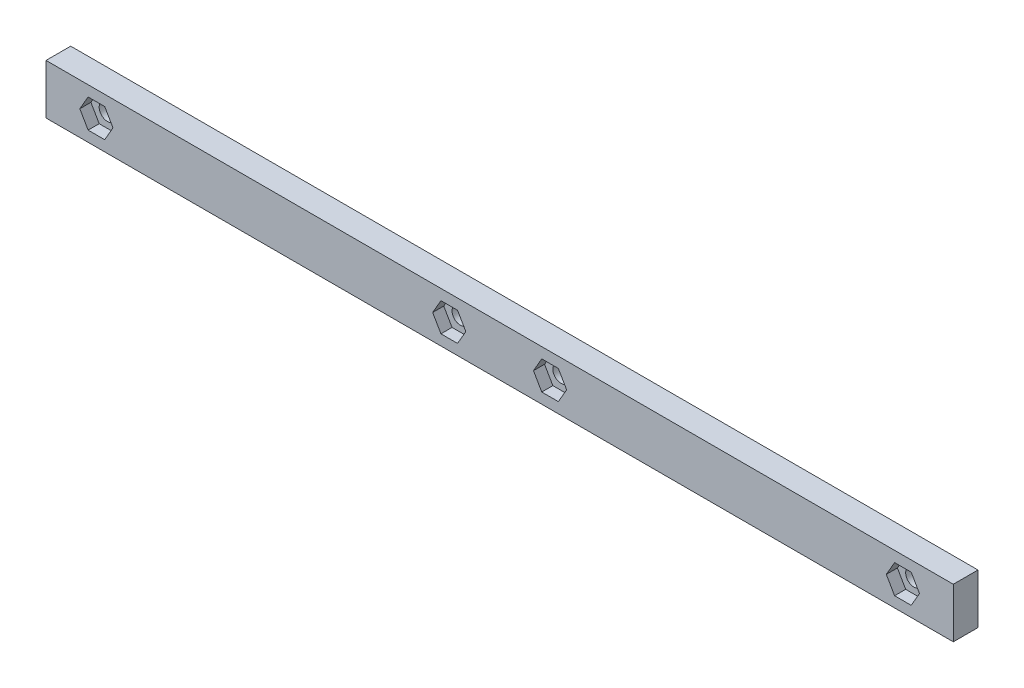
ISO-10303-21;
HEADER;
FILE_DESCRIPTION(('STEP AP214'),'2;1');
FILE_NAME('part.step','',(''),(''),'','','');
FILE_SCHEMA(('AUTOMOTIVE_DESIGN { 1 0 10303 214 1 1 1 1 }'));
ENDSEC;
DATA;
#1=APPLICATION_CONTEXT('core data for automotive mechanical design processes');
#2=APPLICATION_PROTOCOL_DEFINITION('international standard','automotive_design',2000,#1);
#3=PRODUCT_CONTEXT('',#1,'mechanical');
#4=PRODUCT('Part','Part','',(#3));
#5=PRODUCT_RELATED_PRODUCT_CATEGORY('part','',(#4));
#6=PRODUCT_DEFINITION_FORMATION('','',#4);
#7=PRODUCT_DEFINITION_CONTEXT('part definition',#1,'design');
#8=PRODUCT_DEFINITION('design','',#6,#7);
#9=PRODUCT_DEFINITION_SHAPE('','',#8);
#10=(LENGTH_UNIT() NAMED_UNIT(*) SI_UNIT(.MILLI.,.METRE.));
#11=(NAMED_UNIT(*) PLANE_ANGLE_UNIT() SI_UNIT($,.RADIAN.));
#12=(NAMED_UNIT(*) SI_UNIT($,.STERADIAN.) SOLID_ANGLE_UNIT());
#13=UNCERTAINTY_MEASURE_WITH_UNIT(LENGTH_MEASURE(1.E-05),#10,'distance_accuracy_value','');
#14=(GEOMETRIC_REPRESENTATION_CONTEXT(3) GLOBAL_UNCERTAINTY_ASSIGNED_CONTEXT((#13)) GLOBAL_UNIT_ASSIGNED_CONTEXT((#10,
#11,#12)) REPRESENTATION_CONTEXT('',''));
#15=CARTESIAN_POINT('',(0.,0.,0.));
#16=DIRECTION('',(0.,0.,1.));
#17=DIRECTION('',(1.,0.,0.));
#18=AXIS2_PLACEMENT_3D('',#15,#16,#17);
#19=CARTESIAN_POINT('',(23.6426528209278,33.440788784535,-4.9));
#20=DIRECTION('',(0.,0.,1.));
#21=DIRECTION('',(1.,0.,0.));
#22=AXIS2_PLACEMENT_3D('',#19,#20,#21);
#23=CYLINDRICAL_SURFACE('',#22,1.64999999999999);
#24=CARTESIAN_POINT('',(23.6426528209278,33.440788784535,-4.9));
#25=DIRECTION('',(0.,0.,1.));
#26=DIRECTION('',(1.,0.,0.));
#27=AXIS2_PLACEMENT_3D('',#24,#25,#26);
#28=CIRCLE('',#27,1.64999999999999);
#29=CARTESIAN_POINT('',(25.2926528209278,33.440788784535,-4.9));
#30=VERTEX_POINT('',#29);
#31=EDGE_CURVE('E425',#30,#30,#28,.T.);
#32=ORIENTED_EDGE('',*,*,#31,.F.);
#33=EDGE_LOOP('',(#32));
#34=FACE_BOUND('',#33,.T.);
#35=CARTESIAN_POINT('',(23.6426528209278,33.440788784535,-2.2));
#36=DIRECTION('',(0.,0.,1.));
#37=DIRECTION('',(1.,0.,0.));
#38=AXIS2_PLACEMENT_3D('',#35,#36,#37);
#39=CIRCLE('',#38,1.64999999999999);
#40=CARTESIAN_POINT('',(25.2926528209278,33.440788784535,-2.2));
#41=VERTEX_POINT('',#40);
#42=EDGE_CURVE('E43',#41,#41,#39,.F.);
#43=ORIENTED_EDGE('',*,*,#42,.F.);
#44=EDGE_LOOP('',(#43));
#45=FACE_BOUND('',#44,.T.);
#46=ADVANCED_FACE('F39',(#34,#45),#23,.F.);
#47=CARTESIAN_POINT('',(-46.3573471790721,33.440788784535,-4.9));
#48=DIRECTION('',(0.,0.,1.));
#49=DIRECTION('',(1.,0.,0.));
#50=AXIS2_PLACEMENT_3D('',#47,#48,#49);
#51=CYLINDRICAL_SURFACE('',#50,1.65);
#52=CARTESIAN_POINT('',(-46.3573471790721,33.440788784535,-4.9));
#53=DIRECTION('',(0.,0.,1.));
#54=DIRECTION('',(1.,0.,0.));
#55=AXIS2_PLACEMENT_3D('',#52,#53,#54);
#56=CIRCLE('',#55,1.65);
#57=CARTESIAN_POINT('',(-44.7073471790722,33.440788784535,-4.9));
#58=VERTEX_POINT('',#57);
#59=EDGE_CURVE('E428',#58,#58,#56,.T.);
#60=ORIENTED_EDGE('',*,*,#59,.F.);
#61=EDGE_LOOP('',(#60));
#62=FACE_BOUND('',#61,.T.);
#63=CARTESIAN_POINT('',(-46.3573471790721,33.440788784535,-2.2));
#64=DIRECTION('',(0.,0.,1.));
#65=DIRECTION('',(1.,0.,0.));
#66=AXIS2_PLACEMENT_3D('',#63,#64,#65);
#67=CIRCLE('',#66,1.65);
#68=CARTESIAN_POINT('',(-44.7073471790722,33.440788784535,-2.2));
#69=VERTEX_POINT('',#68);
#70=EDGE_CURVE('E317',#69,#69,#67,.F.);
#71=ORIENTED_EDGE('',*,*,#70,.F.);
#72=EDGE_LOOP('',(#71));
#73=FACE_BOUND('',#72,.T.);
#74=ADVANCED_FACE('F477',(#62,#73),#51,.F.);
#75=CARTESIAN_POINT('',(-66.357347179072,33.440788784535,-4.9));
#76=DIRECTION('',(0.,0.,1.));
#77=DIRECTION('',(1.,0.,0.));
#78=AXIS2_PLACEMENT_3D('',#75,#76,#77);
#79=CYLINDRICAL_SURFACE('',#78,1.64999999999999);
#80=CARTESIAN_POINT('',(-66.357347179072,33.440788784535,-4.9));
#81=DIRECTION('',(0.,0.,1.));
#82=DIRECTION('',(1.,0.,0.));
#83=AXIS2_PLACEMENT_3D('',#80,#81,#82);
#84=CIRCLE('',#83,1.64999999999999);
#85=CARTESIAN_POINT('',(-64.707347179072,33.440788784535,-4.9));
#86=VERTEX_POINT('',#85);
#87=EDGE_CURVE('E431',#86,#86,#84,.T.);
#88=ORIENTED_EDGE('',*,*,#87,.F.);
#89=EDGE_LOOP('',(#88));
#90=FACE_BOUND('',#89,.T.);
#91=CARTESIAN_POINT('',(-66.357347179072,33.440788784535,-2.2));
#92=DIRECTION('',(0.,0.,1.));
#93=DIRECTION('',(1.,0.,0.));
#94=AXIS2_PLACEMENT_3D('',#91,#92,#93);
#95=CIRCLE('',#94,1.64999999999999);
#96=CARTESIAN_POINT('',(-64.707347179072,33.440788784535,-2.2));
#97=VERTEX_POINT('',#96);
#98=EDGE_CURVE('E365',#97,#97,#95,.F.);
#99=ORIENTED_EDGE('',*,*,#98,.F.);
#100=EDGE_LOOP('',(#99));
#101=FACE_BOUND('',#100,.T.);
#102=ADVANCED_FACE('F479',(#90,#101),#79,.F.);
#103=CARTESIAN_POINT('',(-136.357347179072,33.4407887845351,-4.9));
#104=DIRECTION('',(0.,0.,1.));
#105=DIRECTION('',(1.,0.,0.));
#106=AXIS2_PLACEMENT_3D('',#103,#104,#105);
#107=CYLINDRICAL_SURFACE('',#106,1.64999999999999);
#108=CARTESIAN_POINT('',(-136.357347179072,33.4407887845351,-4.9));
#109=DIRECTION('',(0.,0.,1.));
#110=DIRECTION('',(1.,0.,0.));
#111=AXIS2_PLACEMENT_3D('',#108,#109,#110);
#112=CIRCLE('',#111,1.64999999999999);
#113=CARTESIAN_POINT('',(-134.707347179072,33.4407887845351,-4.9));
#114=VERTEX_POINT('',#113);
#115=EDGE_CURVE('E434',#114,#114,#112,.T.);
#116=ORIENTED_EDGE('',*,*,#115,.F.);
#117=EDGE_LOOP('',(#116));
#118=FACE_BOUND('',#117,.T.);
#119=CARTESIAN_POINT('',(-136.357347179072,33.4407887845351,-2.2));
#120=DIRECTION('',(0.,0.,1.));
#121=DIRECTION('',(1.,0.,0.));
#122=AXIS2_PLACEMENT_3D('',#119,#120,#121);
#123=CIRCLE('',#122,1.64999999999999);
#124=CARTESIAN_POINT('',(-134.707347179072,33.4407887845351,-2.2));
#125=VERTEX_POINT('',#124);
#126=EDGE_CURVE('E414',#125,#125,#123,.F.);
#127=ORIENTED_EDGE('',*,*,#126,.F.);
#128=EDGE_LOOP('',(#127));
#129=FACE_BOUND('',#128,.T.);
#130=ADVANCED_FACE('F486',(#118,#129),#107,.F.);
#131=CARTESIAN_POINT('',(-146.357347179072,38.3907887845349,-4.9));
#132=DIRECTION('',(-1.,0.,0.));
#133=DIRECTION('',(0.,0.,1.));
#134=AXIS2_PLACEMENT_3D('',#131,#132,#133);
#135=PLANE('',#134);
#136=DIRECTION('',(0.,-1.,0.));
#137=VECTOR('',#136,1.);
#138=CARTESIAN_POINT('',(-146.357347179072,38.3907887845349,0.));
#139=LINE('',#138,#137);
#140=CARTESIAN_POINT('',(-146.357347179072,38.3907887845349,0.));
#141=VERTEX_POINT('',#140);
#142=CARTESIAN_POINT('',(-146.357347179072,28.4907887845349,0.));
#143=VERTEX_POINT('',#142);
#144=EDGE_CURVE('E437',#141,#143,#139,.T.);
#145=ORIENTED_EDGE('',*,*,#144,.F.);
#146=DIRECTION('',(0.,0.,1.));
#147=VECTOR('',#146,1.);
#148=CARTESIAN_POINT('',(-146.357347179072,38.3907887845349,-4.9));
#149=LINE('',#148,#147);
#150=CARTESIAN_POINT('',(-146.357347179072,38.3907887845349,-4.9));
#151=VERTEX_POINT('',#150);
#152=EDGE_CURVE('E11',#151,#141,#149,.T.);
#153=ORIENTED_EDGE('',*,*,#152,.F.);
#154=DIRECTION('',(0.,-1.,0.));
#155=VECTOR('',#154,1.);
#156=CARTESIAN_POINT('',(-146.357347179072,38.3907887845349,-4.9));
#157=LINE('',#156,#155);
#158=CARTESIAN_POINT('',(-146.357347179072,28.4907887845349,-4.9));
#159=VERTEX_POINT('',#158);
#160=EDGE_CURVE('E438',#151,#159,#157,.T.);
#161=ORIENTED_EDGE('',*,*,#160,.T.);
#162=DIRECTION('',(0.,0.,1.));
#163=VECTOR('',#162,1.);
#164=CARTESIAN_POINT('',(-146.357347179072,28.4907887845349,-4.9));
#165=LINE('',#164,#163);
#166=EDGE_CURVE('E453',#159,#143,#165,.T.);
#167=ORIENTED_EDGE('',*,*,#166,.T.);
#168=EDGE_LOOP('',(#145,#153,#161,#167));
#169=FACE_BOUND('',#168,.T.);
#170=ADVANCED_FACE('F41',(#169),#135,.T.);
#171=CARTESIAN_POINT('',(-146.357347179072,38.3907887845349,-4.9));
#172=DIRECTION('',(0.,1.,0.));
#173=DIRECTION('',(0.,0.,1.));
#174=AXIS2_PLACEMENT_3D('',#171,#172,#173);
#175=PLANE('',#174);
#176=DIRECTION('',(-1.,0.,0.));
#177=VECTOR('',#176,1.);
#178=CARTESIAN_POINT('',(-146.357347179072,38.3907887845349,0.));
#179=LINE('',#178,#177);
#180=CARTESIAN_POINT('',(33.6426528209279,38.3907887845349,0.));
#181=VERTEX_POINT('',#180);
#182=EDGE_CURVE('E442',#181,#141,#179,.T.);
#183=ORIENTED_EDGE('',*,*,#182,.F.);
#184=DIRECTION('',(0.,0.,1.));
#185=VECTOR('',#184,1.);
#186=CARTESIAN_POINT('',(33.6426528209279,38.3907887845349,-4.9));
#187=LINE('',#186,#185);
#188=CARTESIAN_POINT('',(33.6426528209279,38.3907887845349,-4.9));
#189=VERTEX_POINT('',#188);
#190=EDGE_CURVE('E48',#189,#181,#187,.T.);
#191=ORIENTED_EDGE('',*,*,#190,.F.);
#192=DIRECTION('',(-1.,0.,0.));
#193=VECTOR('',#192,1.);
#194=CARTESIAN_POINT('',(-146.357347179072,38.3907887845349,-4.9));
#195=LINE('',#194,#193);
#196=EDGE_CURVE('E449',#189,#151,#195,.T.);
#197=ORIENTED_EDGE('',*,*,#196,.T.);
#198=ORIENTED_EDGE('',*,*,#152,.T.);
#199=EDGE_LOOP('',(#183,#191,#197,#198));
#200=FACE_BOUND('',#199,.T.);
#201=ADVANCED_FACE('F507',(#200),#175,.T.);
#202=CARTESIAN_POINT('',(33.6426528209279,38.3907887845349,-4.9));
#203=DIRECTION('',(1.,0.,0.));
#204=DIRECTION('',(0.,0.,-1.));
#205=AXIS2_PLACEMENT_3D('',#202,#203,#204);
#206=PLANE('',#205);
#207=DIRECTION('',(0.,1.,0.));
#208=VECTOR('',#207,1.);
#209=CARTESIAN_POINT('',(33.6426528209279,38.3907887845349,0.));
#210=LINE('',#209,#208);
#211=CARTESIAN_POINT('',(33.6426528209279,28.4907887845349,0.));
#212=VERTEX_POINT('',#211);
#213=EDGE_CURVE('E459',#212,#181,#210,.T.);
#214=ORIENTED_EDGE('',*,*,#213,.F.);
#215=DIRECTION('',(0.,0.,1.));
#216=VECTOR('',#215,1.);
#217=CARTESIAN_POINT('',(33.6426528209279,28.4907887845349,-4.9));
#218=LINE('',#217,#216);
#219=CARTESIAN_POINT('',(33.6426528209279,28.4907887845349,-4.9));
#220=VERTEX_POINT('',#219);
#221=EDGE_CURVE('E466',#220,#212,#218,.T.);
#222=ORIENTED_EDGE('',*,*,#221,.F.);
#223=DIRECTION('',(0.,1.,0.));
#224=VECTOR('',#223,1.);
#225=CARTESIAN_POINT('',(33.6426528209279,38.3907887845349,-4.9));
#226=LINE('',#225,#224);
#227=EDGE_CURVE('E446',#220,#189,#226,.T.);
#228=ORIENTED_EDGE('',*,*,#227,.T.);
#229=ORIENTED_EDGE('',*,*,#190,.T.);
#230=EDGE_LOOP('',(#214,#222,#228,#229));
#231=FACE_BOUND('',#230,.T.);
#232=ADVANCED_FACE('F510',(#231),#206,.T.);
#233=CARTESIAN_POINT('',(-146.357347179072,28.4907887845349,-4.9));
#234=DIRECTION('',(0.,-1.,0.));
#235=DIRECTION('',(0.,0.,-1.));
#236=AXIS2_PLACEMENT_3D('',#233,#234,#235);
#237=PLANE('',#236);
#238=DIRECTION('',(1.,0.,0.));
#239=VECTOR('',#238,1.);
#240=CARTESIAN_POINT('',(-146.357347179072,28.4907887845349,0.));
#241=LINE('',#240,#239);
#242=EDGE_CURVE('E456',#143,#212,#241,.T.);
#243=ORIENTED_EDGE('',*,*,#242,.F.);
#244=ORIENTED_EDGE('',*,*,#166,.F.);
#245=DIRECTION('',(1.,0.,0.));
#246=VECTOR('',#245,1.);
#247=CARTESIAN_POINT('',(-146.357347179072,28.4907887845349,-4.9));
#248=LINE('',#247,#246);
#249=EDGE_CURVE('E441',#159,#220,#248,.T.);
#250=ORIENTED_EDGE('',*,*,#249,.T.);
#251=ORIENTED_EDGE('',*,*,#221,.T.);
#252=EDGE_LOOP('',(#243,#244,#250,#251));
#253=FACE_BOUND('',#252,.T.);
#254=ADVANCED_FACE('F501',(#253),#237,.T.);
#255=CARTESIAN_POINT('',(0.,0.,-4.9));
#256=DIRECTION('',(0.,0.,1.));
#257=DIRECTION('',(1.,0.,0.));
#258=AXIS2_PLACEMENT_3D('',#255,#256,#257);
#259=PLANE('',#258);
#260=ORIENTED_EDGE('',*,*,#31,.T.);
#261=EDGE_LOOP('',(#260));
#262=FACE_BOUND('',#261,.T.);
#263=ORIENTED_EDGE('',*,*,#59,.T.);
#264=EDGE_LOOP('',(#263));
#265=FACE_BOUND('',#264,.T.);
#266=ORIENTED_EDGE('',*,*,#87,.T.);
#267=EDGE_LOOP('',(#266));
#268=FACE_BOUND('',#267,.T.);
#269=ORIENTED_EDGE('',*,*,#115,.T.);
#270=EDGE_LOOP('',(#269));
#271=FACE_BOUND('',#270,.T.);
#272=ORIENTED_EDGE('',*,*,#160,.F.);
#273=ORIENTED_EDGE('',*,*,#196,.F.);
#274=ORIENTED_EDGE('',*,*,#227,.F.);
#275=ORIENTED_EDGE('',*,*,#249,.F.);
#276=EDGE_LOOP('',(#272,#273,#274,#275));
#277=FACE_BOUND('',#276,.T.);
#278=ADVANCED_FACE('F497',(#262,#265,#268,#271,#277),#259,.F.);
#279=CARTESIAN_POINT('',(0.,0.,0.));
#280=DIRECTION('',(0.,0.,1.));
#281=DIRECTION('',(1.,0.,0.));
#282=AXIS2_PLACEMENT_3D('',#279,#280,#281);
#283=PLANE('',#282);
#284=DIRECTION('',(1.,0.,0.));
#285=VECTOR('',#284,1.);
#286=CARTESIAN_POINT('',(21.9972045537373,30.590788784535,0.));
#287=LINE('',#286,#285);
#288=CARTESIAN_POINT('',(21.9972045537373,30.590788784535,0.));
#289=VERTEX_POINT('',#288);
#290=CARTESIAN_POINT('',(25.2881010881182,30.590788784535,0.));
#291=VERTEX_POINT('',#290);
#292=EDGE_CURVE('E56',#289,#291,#287,.T.);
#293=ORIENTED_EDGE('',*,*,#292,.F.);
#294=DIRECTION('',(0.499999999999999,-0.866025403784439,0.));
#295=VECTOR('',#294,1.);
#296=CARTESIAN_POINT('',(20.3517562865469,33.440788784535,0.));
#297=LINE('',#296,#295);
#298=CARTESIAN_POINT('',(20.3517562865469,33.440788784535,0.));
#299=VERTEX_POINT('',#298);
#300=EDGE_CURVE('E247',#299,#289,#297,.T.);
#301=ORIENTED_EDGE('',*,*,#300,.F.);
#302=DIRECTION('',(-0.5,-0.866025403784439,0.));
#303=VECTOR('',#302,1.);
#304=CARTESIAN_POINT('',(21.9972045537373,36.290788784535,0.));
#305=LINE('',#304,#303);
#306=CARTESIAN_POINT('',(21.9972045537373,36.290788784535,0.));
#307=VERTEX_POINT('',#306);
#308=EDGE_CURVE('E250',#307,#299,#305,.T.);
#309=ORIENTED_EDGE('',*,*,#308,.F.);
#310=DIRECTION('',(-1.,0.,0.));
#311=VECTOR('',#310,1.);
#312=CARTESIAN_POINT('',(25.2881010881182,36.290788784535,0.));
#313=LINE('',#312,#311);
#314=CARTESIAN_POINT('',(25.2881010881182,36.290788784535,0.));
#315=VERTEX_POINT('',#314);
#316=EDGE_CURVE('E266',#315,#307,#313,.T.);
#317=ORIENTED_EDGE('',*,*,#316,.F.);
#318=DIRECTION('',(-0.5,0.866025403784439,0.));
#319=VECTOR('',#318,1.);
#320=CARTESIAN_POINT('',(26.9335493553086,33.440788784535,0.));
#321=LINE('',#320,#319);
#322=CARTESIAN_POINT('',(26.9335493553086,33.440788784535,0.));
#323=VERTEX_POINT('',#322);
#324=EDGE_CURVE('E263',#323,#315,#321,.T.);
#325=ORIENTED_EDGE('',*,*,#324,.F.);
#326=DIRECTION('',(0.499999999999999,0.866025403784439,0.));
#327=VECTOR('',#326,1.);
#328=CARTESIAN_POINT('',(25.2881010881182,30.590788784535,0.));
#329=LINE('',#328,#327);
#330=EDGE_CURVE('E261',#291,#323,#329,.T.);
#331=ORIENTED_EDGE('',*,*,#330,.F.);
#332=EDGE_LOOP('',(#293,#301,#309,#317,#325,#331));
#333=FACE_BOUND('',#332,.T.);
#334=DIRECTION('',(1.,0.,0.));
#335=VECTOR('',#334,1.);
#336=CARTESIAN_POINT('',(-48.0027954462626,30.590788784535,0.));
#337=LINE('',#336,#335);
#338=CARTESIAN_POINT('',(-48.0027954462626,30.590788784535,0.));
#339=VERTEX_POINT('',#338);
#340=CARTESIAN_POINT('',(-44.7118989118817,30.590788784535,0.));
#341=VERTEX_POINT('',#340);
#342=EDGE_CURVE('E64',#339,#341,#337,.T.);
#343=ORIENTED_EDGE('',*,*,#342,.F.);
#344=DIRECTION('',(0.5,-0.866025403784439,0.));
#345=VECTOR('',#344,1.);
#346=CARTESIAN_POINT('',(-49.648243713453,33.440788784535,0.));
#347=LINE('',#346,#345);
#348=CARTESIAN_POINT('',(-49.648243713453,33.440788784535,0.));
#349=VERTEX_POINT('',#348);
#350=EDGE_CURVE('E284',#349,#339,#347,.T.);
#351=ORIENTED_EDGE('',*,*,#350,.F.);
#352=DIRECTION('',(-0.499999999999999,-0.866025403784439,0.));
#353=VECTOR('',#352,1.);
#354=CARTESIAN_POINT('',(-48.0027954462626,36.290788784535,0.));
#355=LINE('',#354,#353);
#356=CARTESIAN_POINT('',(-48.0027954462626,36.290788784535,0.));
#357=VERTEX_POINT('',#356);
#358=EDGE_CURVE('E310',#357,#349,#355,.T.);
#359=ORIENTED_EDGE('',*,*,#358,.F.);
#360=DIRECTION('',(-1.,0.,0.));
#361=VECTOR('',#360,1.);
#362=CARTESIAN_POINT('',(-44.7118989118817,36.290788784535,0.));
#363=LINE('',#362,#361);
#364=CARTESIAN_POINT('',(-44.7118989118817,36.290788784535,0.));
#365=VERTEX_POINT('',#364);
#366=EDGE_CURVE('E307',#365,#357,#363,.T.);
#367=ORIENTED_EDGE('',*,*,#366,.F.);
#368=DIRECTION('',(-0.5,0.866025403784439,0.));
#369=VECTOR('',#368,1.);
#370=CARTESIAN_POINT('',(-43.0664506446913,33.440788784535,0.));
#371=LINE('',#370,#369);
#372=CARTESIAN_POINT('',(-43.0664506446913,33.440788784535,0.));
#373=VERTEX_POINT('',#372);
#374=EDGE_CURVE('E304',#373,#365,#371,.T.);
#375=ORIENTED_EDGE('',*,*,#374,.F.);
#376=DIRECTION('',(0.499999999999999,0.866025403784439,0.));
#377=VECTOR('',#376,1.);
#378=CARTESIAN_POINT('',(-44.7118989118817,30.590788784535,0.));
#379=LINE('',#378,#377);
#380=EDGE_CURVE('E301',#341,#373,#379,.T.);
#381=ORIENTED_EDGE('',*,*,#380,.F.);
#382=EDGE_LOOP('',(#343,#351,#359,#367,#375,#381));
#383=FACE_BOUND('',#382,.T.);
#384=DIRECTION('',(1.,0.,0.));
#385=VECTOR('',#384,1.);
#386=CARTESIAN_POINT('',(-68.0027954462624,30.590788784535,0.));
#387=LINE('',#386,#385);
#388=CARTESIAN_POINT('',(-68.0027954462624,30.590788784535,0.));
#389=VERTEX_POINT('',#388);
#390=CARTESIAN_POINT('',(-64.7118989118815,30.590788784535,0.));
#391=VERTEX_POINT('',#390);
#392=EDGE_CURVE('E347',#389,#391,#387,.T.);
#393=ORIENTED_EDGE('',*,*,#392,.F.);
#394=DIRECTION('',(0.499999999999998,-0.86602540378444,0.));
#395=VECTOR('',#394,1.);
#396=CARTESIAN_POINT('',(-69.6482437134529,33.440788784535,0.));
#397=LINE('',#396,#395);
#398=CARTESIAN_POINT('',(-69.6482437134529,33.440788784535,0.));
#399=VERTEX_POINT('',#398);
#400=EDGE_CURVE('E331',#399,#389,#397,.T.);
#401=ORIENTED_EDGE('',*,*,#400,.F.);
#402=DIRECTION('',(-0.499999999999999,-0.866025403784439,0.));
#403=VECTOR('',#402,1.);
#404=CARTESIAN_POINT('',(-68.0027954462624,36.290788784535,0.));
#405=LINE('',#404,#403);
#406=CARTESIAN_POINT('',(-68.0027954462624,36.290788784535,0.));
#407=VERTEX_POINT('',#406);
#408=EDGE_CURVE('E358',#407,#399,#405,.T.);
#409=ORIENTED_EDGE('',*,*,#408,.F.);
#410=DIRECTION('',(-1.,0.,0.));
#411=VECTOR('',#410,1.);
#412=CARTESIAN_POINT('',(-64.7118989118816,36.290788784535,0.));
#413=LINE('',#412,#411);
#414=CARTESIAN_POINT('',(-64.7118989118816,36.290788784535,0.));
#415=VERTEX_POINT('',#414);
#416=EDGE_CURVE('E355',#415,#407,#413,.T.);
#417=ORIENTED_EDGE('',*,*,#416,.F.);
#418=DIRECTION('',(-0.5,0.866025403784439,0.));
#419=VECTOR('',#418,1.);
#420=CARTESIAN_POINT('',(-63.0664506446911,33.440788784535,0.));
#421=LINE('',#420,#419);
#422=CARTESIAN_POINT('',(-63.0664506446911,33.440788784535,0.));
#423=VERTEX_POINT('',#422);
#424=EDGE_CURVE('E352',#423,#415,#421,.T.);
#425=ORIENTED_EDGE('',*,*,#424,.F.);
#426=DIRECTION('',(0.5,0.866025403784439,0.));
#427=VECTOR('',#426,1.);
#428=CARTESIAN_POINT('',(-64.7118989118815,30.590788784535,0.));
#429=LINE('',#428,#427);
#430=EDGE_CURVE('E349',#391,#423,#429,.T.);
#431=ORIENTED_EDGE('',*,*,#430,.F.);
#432=EDGE_LOOP('',(#393,#401,#409,#417,#425,#431));
#433=FACE_BOUND('',#432,.T.);
#434=DIRECTION('',(1.,0.,0.));
#435=VECTOR('',#434,1.);
#436=CARTESIAN_POINT('',(-138.002795446262,30.5907887845352,0.));
#437=LINE('',#436,#435);
#438=CARTESIAN_POINT('',(-138.002795446262,30.5907887845352,0.));
#439=VERTEX_POINT('',#438);
#440=CARTESIAN_POINT('',(-134.711898911881,30.5907887845352,0.));
#441=VERTEX_POINT('',#440);
#442=EDGE_CURVE('E396',#439,#441,#437,.T.);
#443=ORIENTED_EDGE('',*,*,#442,.F.);
#444=DIRECTION('',(0.5,-0.866025403784439,0.));
#445=VECTOR('',#444,1.);
#446=CARTESIAN_POINT('',(-139.648243713453,33.4407887845351,0.));
#447=LINE('',#446,#445);
#448=CARTESIAN_POINT('',(-139.648243713453,33.4407887845351,0.));
#449=VERTEX_POINT('',#448);
#450=EDGE_CURVE('E380',#449,#439,#447,.T.);
#451=ORIENTED_EDGE('',*,*,#450,.F.);
#452=DIRECTION('',(-0.499999999999997,-0.866025403784441,0.));
#453=VECTOR('',#452,1.);
#454=CARTESIAN_POINT('',(-138.002795446262,36.2907887845351,0.));
#455=LINE('',#454,#453);
#456=CARTESIAN_POINT('',(-138.002795446262,36.2907887845351,0.));
#457=VERTEX_POINT('',#456);
#458=EDGE_CURVE('E407',#457,#449,#455,.T.);
#459=ORIENTED_EDGE('',*,*,#458,.F.);
#460=DIRECTION('',(-1.,0.,0.));
#461=VECTOR('',#460,1.);
#462=CARTESIAN_POINT('',(-134.711898911881,36.2907887845351,0.));
#463=LINE('',#462,#461);
#464=CARTESIAN_POINT('',(-134.711898911881,36.2907887845351,0.));
#465=VERTEX_POINT('',#464);
#466=EDGE_CURVE('E404',#465,#457,#463,.T.);
#467=ORIENTED_EDGE('',*,*,#466,.F.);
#468=DIRECTION('',(-0.500000000000001,0.866025403784438,0.));
#469=VECTOR('',#468,1.);
#470=CARTESIAN_POINT('',(-133.066450644691,33.4407887845351,0.));
#471=LINE('',#470,#469);
#472=CARTESIAN_POINT('',(-133.066450644691,33.4407887845351,0.));
#473=VERTEX_POINT('',#472);
#474=EDGE_CURVE('E401',#473,#465,#471,.T.);
#475=ORIENTED_EDGE('',*,*,#474,.F.);
#476=DIRECTION('',(0.500000000000001,0.866025403784438,0.));
#477=VECTOR('',#476,1.);
#478=CARTESIAN_POINT('',(-134.711898911881,30.5907887845352,0.));
#479=LINE('',#478,#477);
#480=EDGE_CURVE('E398',#441,#473,#479,.T.);
#481=ORIENTED_EDGE('',*,*,#480,.F.);
#482=EDGE_LOOP('',(#443,#451,#459,#467,#475,#481));
#483=FACE_BOUND('',#482,.T.);
#484=ORIENTED_EDGE('',*,*,#144,.T.);
#485=ORIENTED_EDGE('',*,*,#242,.T.);
#486=ORIENTED_EDGE('',*,*,#213,.T.);
#487=ORIENTED_EDGE('',*,*,#182,.T.);
#488=EDGE_LOOP('',(#484,#485,#486,#487));
#489=FACE_BOUND('',#488,.T.);
#490=ADVANCED_FACE('F500',(#333,#383,#433,#483,#489),#283,.T.);
#491=CARTESIAN_POINT('',(0.,0.,-2.2));
#492=DIRECTION('',(0.,0.,1.));
#493=DIRECTION('',(1.,0.,0.));
#494=AXIS2_PLACEMENT_3D('',#491,#492,#493);
#495=PLANE('',#494);
#496=DIRECTION('',(1.,0.,0.));
#497=VECTOR('',#496,1.);
#498=CARTESIAN_POINT('',(-138.002795446262,30.5907887845352,-2.2));
#499=LINE('',#498,#497);
#500=CARTESIAN_POINT('',(-138.002795446262,30.5907887845352,-2.2));
#501=VERTEX_POINT('',#500);
#502=CARTESIAN_POINT('',(-134.711898911881,30.5907887845352,-2.2));
#503=VERTEX_POINT('',#502);
#504=EDGE_CURVE('E376',#501,#503,#499,.T.);
#505=ORIENTED_EDGE('',*,*,#504,.T.);
#506=DIRECTION('',(0.500000000000001,0.866025403784438,0.));
#507=VECTOR('',#506,1.);
#508=CARTESIAN_POINT('',(-134.711898911881,30.5907887845352,-2.2));
#509=LINE('',#508,#507);
#510=CARTESIAN_POINT('',(-133.066450644691,33.4407887845351,-2.2));
#511=VERTEX_POINT('',#510);
#512=EDGE_CURVE('E379',#503,#511,#509,.T.);
#513=ORIENTED_EDGE('',*,*,#512,.T.);
#514=DIRECTION('',(-0.500000000000001,0.866025403784438,0.));
#515=VECTOR('',#514,1.);
#516=CARTESIAN_POINT('',(-133.066450644691,33.4407887845351,-2.2));
#517=LINE('',#516,#515);
#518=CARTESIAN_POINT('',(-134.711898911881,36.2907887845351,-2.2));
#519=VERTEX_POINT('',#518);
#520=EDGE_CURVE('E383',#511,#519,#517,.T.);
#521=ORIENTED_EDGE('',*,*,#520,.T.);
#522=DIRECTION('',(-1.,0.,0.));
#523=VECTOR('',#522,1.);
#524=CARTESIAN_POINT('',(-134.711898911881,36.2907887845351,-2.2));
#525=LINE('',#524,#523);
#526=CARTESIAN_POINT('',(-138.002795446262,36.2907887845351,-2.2));
#527=VERTEX_POINT('',#526);
#528=EDGE_CURVE('E386',#519,#527,#525,.T.);
#529=ORIENTED_EDGE('',*,*,#528,.T.);
#530=DIRECTION('',(-0.499999999999997,-0.866025403784441,0.));
#531=VECTOR('',#530,1.);
#532=CARTESIAN_POINT('',(-138.002795446262,36.2907887845351,-2.2));
#533=LINE('',#532,#531);
#534=CARTESIAN_POINT('',(-139.648243713453,33.4407887845351,-2.2));
#535=VERTEX_POINT('',#534);
#536=EDGE_CURVE('E389',#527,#535,#533,.T.);
#537=ORIENTED_EDGE('',*,*,#536,.T.);
#538=DIRECTION('',(0.5,-0.866025403784439,0.));
#539=VECTOR('',#538,1.);
#540=CARTESIAN_POINT('',(-139.648243713453,33.4407887845351,-2.2));
#541=LINE('',#540,#539);
#542=EDGE_CURVE('E392',#535,#501,#541,.T.);
#543=ORIENTED_EDGE('',*,*,#542,.T.);
#544=EDGE_LOOP('',(#505,#513,#521,#529,#537,#543));
#545=FACE_BOUND('',#544,.T.);
#546=ORIENTED_EDGE('',*,*,#126,.T.);
#547=EDGE_LOOP('',(#546));
#548=FACE_BOUND('',#547,.T.);
#549=ADVANCED_FACE('F505',(#545,#548),#495,.T.);
#550=CARTESIAN_POINT('',(-138.002795446262,30.5907887845352,-2.2));
#551=DIRECTION('',(0.,-1.,0.));
#552=DIRECTION('',(0.,0.,-1.));
#553=AXIS2_PLACEMENT_3D('',#550,#551,#552);
#554=PLANE('',#553);
#555=ORIENTED_EDGE('',*,*,#442,.T.);
#556=DIRECTION('',(0.,0.,1.));
#557=VECTOR('',#556,1.);
#558=CARTESIAN_POINT('',(-134.711898911881,30.5907887845352,-2.2));
#559=LINE('',#558,#557);
#560=EDGE_CURVE('E395',#503,#441,#559,.T.);
#561=ORIENTED_EDGE('',*,*,#560,.F.);
#562=ORIENTED_EDGE('',*,*,#504,.F.);
#563=DIRECTION('',(0.,0.,1.));
#564=VECTOR('',#563,1.);
#565=CARTESIAN_POINT('',(-138.002795446262,30.5907887845352,-2.2));
#566=LINE('',#565,#564);
#567=EDGE_CURVE('E412',#501,#439,#566,.T.);
#568=ORIENTED_EDGE('',*,*,#567,.T.);
#569=EDGE_LOOP('',(#555,#561,#562,#568));
#570=FACE_BOUND('',#569,.T.);
#571=ADVANCED_FACE('F588',(#570),#554,.F.);
#572=CARTESIAN_POINT('',(-139.648243713453,33.4407887845351,-2.2));
#573=DIRECTION('',(-0.866025403784439,-0.5,0.));
#574=DIRECTION('',(0.5,-0.866025403784439,0.));
#575=AXIS2_PLACEMENT_3D('',#572,#573,#574);
#576=PLANE('',#575);
#577=ORIENTED_EDGE('',*,*,#450,.T.);
#578=ORIENTED_EDGE('',*,*,#567,.F.);
#579=ORIENTED_EDGE('',*,*,#542,.F.);
#580=DIRECTION('',(0.,0.,1.));
#581=VECTOR('',#580,1.);
#582=CARTESIAN_POINT('',(-139.648243713453,33.4407887845351,-2.2));
#583=LINE('',#582,#581);
#584=EDGE_CURVE('E415',#535,#449,#583,.T.);
#585=ORIENTED_EDGE('',*,*,#584,.T.);
#586=EDGE_LOOP('',(#577,#578,#579,#585));
#587=FACE_BOUND('',#586,.T.);
#588=ADVANCED_FACE('F598',(#587),#576,.F.);
#589=CARTESIAN_POINT('',(-138.002795446262,36.2907887845351,-2.2));
#590=DIRECTION('',(-0.866025403784441,0.499999999999997,0.));
#591=DIRECTION('',(-0.499999999999997,-0.866025403784441,0.));
#592=AXIS2_PLACEMENT_3D('',#589,#590,#591);
#593=PLANE('',#592);
#594=ORIENTED_EDGE('',*,*,#458,.T.);
#595=ORIENTED_EDGE('',*,*,#584,.F.);
#596=ORIENTED_EDGE('',*,*,#536,.F.);
#597=DIRECTION('',(0.,0.,1.));
#598=VECTOR('',#597,1.);
#599=CARTESIAN_POINT('',(-138.002795446262,36.2907887845351,-2.2));
#600=LINE('',#599,#598);
#601=EDGE_CURVE('E417',#527,#457,#600,.T.);
#602=ORIENTED_EDGE('',*,*,#601,.T.);
#603=EDGE_LOOP('',(#594,#595,#596,#602));
#604=FACE_BOUND('',#603,.T.);
#605=ADVANCED_FACE('F607',(#604),#593,.F.);
#606=CARTESIAN_POINT('',(-134.711898911881,36.2907887845351,-2.2));
#607=DIRECTION('',(0.,1.,0.));
#608=DIRECTION('',(0.,0.,1.));
#609=AXIS2_PLACEMENT_3D('',#606,#607,#608);
#610=PLANE('',#609);
#611=ORIENTED_EDGE('',*,*,#466,.T.);
#612=ORIENTED_EDGE('',*,*,#601,.F.);
#613=ORIENTED_EDGE('',*,*,#528,.F.);
#614=DIRECTION('',(0.,0.,1.));
#615=VECTOR('',#614,1.);
#616=CARTESIAN_POINT('',(-134.711898911881,36.2907887845351,-2.2));
#617=LINE('',#616,#615);
#618=EDGE_CURVE('E419',#519,#465,#617,.T.);
#619=ORIENTED_EDGE('',*,*,#618,.T.);
#620=EDGE_LOOP('',(#611,#612,#613,#619));
#621=FACE_BOUND('',#620,.T.);
#622=ADVANCED_FACE('F617',(#621),#610,.F.);
#623=CARTESIAN_POINT('',(-133.066450644691,33.4407887845351,-2.2));
#624=DIRECTION('',(0.866025403784438,0.500000000000001,0.));
#625=DIRECTION('',(-0.500000000000001,0.866025403784438,0.));
#626=AXIS2_PLACEMENT_3D('',#623,#624,#625);
#627=PLANE('',#626);
#628=ORIENTED_EDGE('',*,*,#474,.T.);
#629=ORIENTED_EDGE('',*,*,#618,.F.);
#630=ORIENTED_EDGE('',*,*,#520,.F.);
#631=DIRECTION('',(0.,0.,1.));
#632=VECTOR('',#631,1.);
#633=CARTESIAN_POINT('',(-133.066450644691,33.4407887845351,-2.2));
#634=LINE('',#633,#632);
#635=EDGE_CURVE('E421',#511,#473,#634,.T.);
#636=ORIENTED_EDGE('',*,*,#635,.T.);
#637=EDGE_LOOP('',(#628,#629,#630,#636));
#638=FACE_BOUND('',#637,.T.);
#639=ADVANCED_FACE('F627',(#638),#627,.F.);
#640=CARTESIAN_POINT('',(-134.711898911881,30.5907887845352,-2.2));
#641=DIRECTION('',(0.866025403784438,-0.500000000000001,0.));
#642=DIRECTION('',(0.500000000000001,0.866025403784438,0.));
#643=AXIS2_PLACEMENT_3D('',#640,#641,#642);
#644=PLANE('',#643);
#645=ORIENTED_EDGE('',*,*,#480,.T.);
#646=ORIENTED_EDGE('',*,*,#635,.F.);
#647=ORIENTED_EDGE('',*,*,#512,.F.);
#648=ORIENTED_EDGE('',*,*,#560,.T.);
#649=EDGE_LOOP('',(#645,#646,#647,#648));
#650=FACE_BOUND('',#649,.T.);
#651=ADVANCED_FACE('F637',(#650),#644,.F.);
#652=CARTESIAN_POINT('',(0.,0.,-2.2));
#653=DIRECTION('',(0.,0.,1.));
#654=DIRECTION('',(1.,0.,0.));
#655=AXIS2_PLACEMENT_3D('',#652,#653,#654);
#656=PLANE('',#655);
#657=DIRECTION('',(1.,0.,0.));
#658=VECTOR('',#657,1.);
#659=CARTESIAN_POINT('',(-68.0027954462624,30.590788784535,-2.2));
#660=LINE('',#659,#658);
#661=CARTESIAN_POINT('',(-68.0027954462624,30.590788784535,-2.2));
#662=VERTEX_POINT('',#661);
#663=CARTESIAN_POINT('',(-64.7118989118815,30.590788784535,-2.2));
#664=VERTEX_POINT('',#663);
#665=EDGE_CURVE('E327',#662,#664,#660,.T.);
#666=ORIENTED_EDGE('',*,*,#665,.T.);
#667=DIRECTION('',(0.5,0.866025403784439,0.));
#668=VECTOR('',#667,1.);
#669=CARTESIAN_POINT('',(-64.7118989118815,30.590788784535,-2.2));
#670=LINE('',#669,#668);
#671=CARTESIAN_POINT('',(-63.0664506446911,33.440788784535,-2.2));
#672=VERTEX_POINT('',#671);
#673=EDGE_CURVE('E330',#664,#672,#670,.T.);
#674=ORIENTED_EDGE('',*,*,#673,.T.);
#675=DIRECTION('',(-0.5,0.866025403784439,0.));
#676=VECTOR('',#675,1.);
#677=CARTESIAN_POINT('',(-63.0664506446911,33.440788784535,-2.2));
#678=LINE('',#677,#676);
#679=CARTESIAN_POINT('',(-64.7118989118816,36.290788784535,-2.2));
#680=VERTEX_POINT('',#679);
#681=EDGE_CURVE('E334',#672,#680,#678,.T.);
#682=ORIENTED_EDGE('',*,*,#681,.T.);
#683=DIRECTION('',(-1.,0.,0.));
#684=VECTOR('',#683,1.);
#685=CARTESIAN_POINT('',(-64.7118989118816,36.290788784535,-2.2));
#686=LINE('',#685,#684);
#687=CARTESIAN_POINT('',(-68.0027954462624,36.290788784535,-2.2));
#688=VERTEX_POINT('',#687);
#689=EDGE_CURVE('E337',#680,#688,#686,.T.);
#690=ORIENTED_EDGE('',*,*,#689,.T.);
#691=DIRECTION('',(-0.499999999999999,-0.866025403784439,0.));
#692=VECTOR('',#691,1.);
#693=CARTESIAN_POINT('',(-68.0027954462624,36.290788784535,-2.2));
#694=LINE('',#693,#692);
#695=CARTESIAN_POINT('',(-69.6482437134529,33.440788784535,-2.2));
#696=VERTEX_POINT('',#695);
#697=EDGE_CURVE('E340',#688,#696,#694,.T.);
#698=ORIENTED_EDGE('',*,*,#697,.T.);
#699=DIRECTION('',(0.499999999999998,-0.86602540378444,0.));
#700=VECTOR('',#699,1.);
#701=CARTESIAN_POINT('',(-69.6482437134529,33.440788784535,-2.2));
#702=LINE('',#701,#700);
#703=EDGE_CURVE('E343',#696,#662,#702,.T.);
#704=ORIENTED_EDGE('',*,*,#703,.T.);
#705=EDGE_LOOP('',(#666,#674,#682,#690,#698,#704));
#706=FACE_BOUND('',#705,.T.);
#707=ORIENTED_EDGE('',*,*,#98,.T.);
#708=EDGE_LOOP('',(#707));
#709=FACE_BOUND('',#708,.T.);
#710=ADVANCED_FACE('F647',(#706,#709),#656,.T.);
#711=CARTESIAN_POINT('',(-68.0027954462624,30.590788784535,-2.2));
#712=DIRECTION('',(0.,-1.,0.));
#713=DIRECTION('',(0.,0.,-1.));
#714=AXIS2_PLACEMENT_3D('',#711,#712,#713);
#715=PLANE('',#714);
#716=ORIENTED_EDGE('',*,*,#392,.T.);
#717=DIRECTION('',(0.,0.,1.));
#718=VECTOR('',#717,1.);
#719=CARTESIAN_POINT('',(-64.7118989118815,30.590788784535,-2.2));
#720=LINE('',#719,#718);
#721=EDGE_CURVE('E346',#664,#391,#720,.T.);
#722=ORIENTED_EDGE('',*,*,#721,.F.);
#723=ORIENTED_EDGE('',*,*,#665,.F.);
#724=DIRECTION('',(0.,0.,1.));
#725=VECTOR('',#724,1.);
#726=CARTESIAN_POINT('',(-68.0027954462624,30.590788784535,-2.2));
#727=LINE('',#726,#725);
#728=EDGE_CURVE('E363',#662,#389,#727,.T.);
#729=ORIENTED_EDGE('',*,*,#728,.T.);
#730=EDGE_LOOP('',(#716,#722,#723,#729));
#731=FACE_BOUND('',#730,.T.);
#732=ADVANCED_FACE('F657',(#731),#715,.F.);
#733=CARTESIAN_POINT('',(-69.6482437134529,33.440788784535,-2.2));
#734=DIRECTION('',(-0.86602540378444,-0.499999999999998,0.));
#735=DIRECTION('',(0.499999999999998,-0.86602540378444,0.));
#736=AXIS2_PLACEMENT_3D('',#733,#734,#735);
#737=PLANE('',#736);
#738=ORIENTED_EDGE('',*,*,#400,.T.);
#739=ORIENTED_EDGE('',*,*,#728,.F.);
#740=ORIENTED_EDGE('',*,*,#703,.F.);
#741=DIRECTION('',(0.,0.,1.));
#742=VECTOR('',#741,1.);
#743=CARTESIAN_POINT('',(-69.6482437134529,33.440788784535,-2.2));
#744=LINE('',#743,#742);
#745=EDGE_CURVE('E366',#696,#399,#744,.T.);
#746=ORIENTED_EDGE('',*,*,#745,.T.);
#747=EDGE_LOOP('',(#738,#739,#740,#746));
#748=FACE_BOUND('',#747,.T.);
#749=ADVANCED_FACE('F667',(#748),#737,.F.);
#750=CARTESIAN_POINT('',(-68.0027954462624,36.290788784535,-2.2));
#751=DIRECTION('',(-0.866025403784439,0.499999999999999,0.));
#752=DIRECTION('',(-0.499999999999999,-0.86602540378444,0.));
#753=AXIS2_PLACEMENT_3D('',#750,#751,#752);
#754=PLANE('',#753);
#755=ORIENTED_EDGE('',*,*,#408,.T.);
#756=ORIENTED_EDGE('',*,*,#745,.F.);
#757=ORIENTED_EDGE('',*,*,#697,.F.);
#758=DIRECTION('',(0.,0.,1.));
#759=VECTOR('',#758,1.);
#760=CARTESIAN_POINT('',(-68.0027954462624,36.290788784535,-2.2));
#761=LINE('',#760,#759);
#762=EDGE_CURVE('E368',#688,#407,#761,.T.);
#763=ORIENTED_EDGE('',*,*,#762,.T.);
#764=EDGE_LOOP('',(#755,#756,#757,#763));
#765=FACE_BOUND('',#764,.T.);
#766=ADVANCED_FACE('F677',(#765),#754,.F.);
#767=CARTESIAN_POINT('',(-64.7118989118816,36.290788784535,-2.2));
#768=DIRECTION('',(0.,1.,0.));
#769=DIRECTION('',(0.,0.,1.));
#770=AXIS2_PLACEMENT_3D('',#767,#768,#769);
#771=PLANE('',#770);
#772=ORIENTED_EDGE('',*,*,#416,.T.);
#773=ORIENTED_EDGE('',*,*,#762,.F.);
#774=ORIENTED_EDGE('',*,*,#689,.F.);
#775=DIRECTION('',(0.,0.,1.));
#776=VECTOR('',#775,1.);
#777=CARTESIAN_POINT('',(-64.7118989118816,36.290788784535,-2.2));
#778=LINE('',#777,#776);
#779=EDGE_CURVE('E370',#680,#415,#778,.T.);
#780=ORIENTED_EDGE('',*,*,#779,.T.);
#781=EDGE_LOOP('',(#772,#773,#774,#780));
#782=FACE_BOUND('',#781,.T.);
#783=ADVANCED_FACE('F687',(#782),#771,.F.);
#784=CARTESIAN_POINT('',(-63.0664506446911,33.440788784535,-2.2));
#785=DIRECTION('',(0.866025403784439,0.5,0.));
#786=DIRECTION('',(-0.5,0.866025403784439,0.));
#787=AXIS2_PLACEMENT_3D('',#784,#785,#786);
#788=PLANE('',#787);
#789=ORIENTED_EDGE('',*,*,#424,.T.);
#790=ORIENTED_EDGE('',*,*,#779,.F.);
#791=ORIENTED_EDGE('',*,*,#681,.F.);
#792=DIRECTION('',(0.,0.,1.));
#793=VECTOR('',#792,1.);
#794=CARTESIAN_POINT('',(-63.0664506446911,33.440788784535,-2.2));
#795=LINE('',#794,#793);
#796=EDGE_CURVE('E372',#672,#423,#795,.T.);
#797=ORIENTED_EDGE('',*,*,#796,.T.);
#798=EDGE_LOOP('',(#789,#790,#791,#797));
#799=FACE_BOUND('',#798,.T.);
#800=ADVANCED_FACE('F697',(#799),#788,.F.);
#801=CARTESIAN_POINT('',(-64.7118989118815,30.590788784535,-2.2));
#802=DIRECTION('',(0.866025403784439,-0.5,0.));
#803=DIRECTION('',(0.5,0.866025403784439,0.));
#804=AXIS2_PLACEMENT_3D('',#801,#802,#803);
#805=PLANE('',#804);
#806=ORIENTED_EDGE('',*,*,#430,.T.);
#807=ORIENTED_EDGE('',*,*,#796,.F.);
#808=ORIENTED_EDGE('',*,*,#673,.F.);
#809=ORIENTED_EDGE('',*,*,#721,.T.);
#810=EDGE_LOOP('',(#806,#807,#808,#809));
#811=FACE_BOUND('',#810,.T.);
#812=ADVANCED_FACE('F707',(#811),#805,.F.);
#813=CARTESIAN_POINT('',(0.,0.,-2.2));
#814=DIRECTION('',(0.,0.,1.));
#815=DIRECTION('',(1.,0.,0.));
#816=AXIS2_PLACEMENT_3D('',#813,#814,#815);
#817=PLANE('',#816);
#818=DIRECTION('',(1.,0.,0.));
#819=VECTOR('',#818,1.);
#820=CARTESIAN_POINT('',(-48.0027954462626,30.590788784535,-2.2));
#821=LINE('',#820,#819);
#822=CARTESIAN_POINT('',(-48.0027954462626,30.590788784535,-2.2));
#823=VERTEX_POINT('',#822);
#824=CARTESIAN_POINT('',(-44.7118989118817,30.590788784535,-2.2));
#825=VERTEX_POINT('',#824);
#826=EDGE_CURVE('E280',#823,#825,#821,.T.);
#827=ORIENTED_EDGE('',*,*,#826,.T.);
#828=DIRECTION('',(0.499999999999999,0.866025403784439,0.));
#829=VECTOR('',#828,1.);
#830=CARTESIAN_POINT('',(-44.7118989118817,30.590788784535,-2.2));
#831=LINE('',#830,#829);
#832=CARTESIAN_POINT('',(-43.0664506446913,33.440788784535,-2.2));
#833=VERTEX_POINT('',#832);
#834=EDGE_CURVE('E283',#825,#833,#831,.T.);
#835=ORIENTED_EDGE('',*,*,#834,.T.);
#836=DIRECTION('',(-0.5,0.866025403784439,0.));
#837=VECTOR('',#836,1.);
#838=CARTESIAN_POINT('',(-43.0664506446913,33.440788784535,-2.2));
#839=LINE('',#838,#837);
#840=CARTESIAN_POINT('',(-44.7118989118817,36.290788784535,-2.2));
#841=VERTEX_POINT('',#840);
#842=EDGE_CURVE('E287',#833,#841,#839,.T.);
#843=ORIENTED_EDGE('',*,*,#842,.T.);
#844=DIRECTION('',(-1.,0.,0.));
#845=VECTOR('',#844,1.);
#846=CARTESIAN_POINT('',(-44.7118989118817,36.290788784535,-2.2));
#847=LINE('',#846,#845);
#848=CARTESIAN_POINT('',(-48.0027954462626,36.290788784535,-2.2));
#849=VERTEX_POINT('',#848);
#850=EDGE_CURVE('E290',#841,#849,#847,.T.);
#851=ORIENTED_EDGE('',*,*,#850,.T.);
#852=DIRECTION('',(-0.499999999999999,-0.866025403784439,0.));
#853=VECTOR('',#852,1.);
#854=CARTESIAN_POINT('',(-48.0027954462626,36.290788784535,-2.2));
#855=LINE('',#854,#853);
#856=CARTESIAN_POINT('',(-49.648243713453,33.440788784535,-2.2));
#857=VERTEX_POINT('',#856);
#858=EDGE_CURVE('E293',#849,#857,#855,.T.);
#859=ORIENTED_EDGE('',*,*,#858,.T.);
#860=DIRECTION('',(0.5,-0.866025403784439,0.));
#861=VECTOR('',#860,1.);
#862=CARTESIAN_POINT('',(-49.648243713453,33.440788784535,-2.2));
#863=LINE('',#862,#861);
#864=EDGE_CURVE('E296',#857,#823,#863,.T.);
#865=ORIENTED_EDGE('',*,*,#864,.T.);
#866=EDGE_LOOP('',(#827,#835,#843,#851,#859,#865));
#867=FACE_BOUND('',#866,.T.);
#868=ORIENTED_EDGE('',*,*,#70,.T.);
#869=EDGE_LOOP('',(#868));
#870=FACE_BOUND('',#869,.T.);
#871=ADVANCED_FACE('F475',(#867,#870),#817,.T.);
#872=CARTESIAN_POINT('',(-48.0027954462626,30.590788784535,-2.2));
#873=DIRECTION('',(0.,-1.,0.));
#874=DIRECTION('',(0.,0.,-1.));
#875=AXIS2_PLACEMENT_3D('',#872,#873,#874);
#876=PLANE('',#875);
#877=ORIENTED_EDGE('',*,*,#342,.T.);
#878=DIRECTION('',(0.,0.,1.));
#879=VECTOR('',#878,1.);
#880=CARTESIAN_POINT('',(-44.7118989118817,30.590788784535,-2.2));
#881=LINE('',#880,#879);
#882=EDGE_CURVE('E299',#825,#341,#881,.T.);
#883=ORIENTED_EDGE('',*,*,#882,.F.);
#884=ORIENTED_EDGE('',*,*,#826,.F.);
#885=DIRECTION('',(0.,0.,1.));
#886=VECTOR('',#885,1.);
#887=CARTESIAN_POINT('',(-48.0027954462626,30.590788784535,-2.2));
#888=LINE('',#887,#886);
#889=EDGE_CURVE('E315',#823,#339,#888,.T.);
#890=ORIENTED_EDGE('',*,*,#889,.T.);
#891=EDGE_LOOP('',(#877,#883,#884,#890));
#892=FACE_BOUND('',#891,.T.);
#893=ADVANCED_FACE('F726',(#892),#876,.F.);
#894=CARTESIAN_POINT('',(-49.648243713453,33.440788784535,-2.2));
#895=DIRECTION('',(-0.866025403784439,-0.5,0.));
#896=DIRECTION('',(0.5,-0.866025403784439,0.));
#897=AXIS2_PLACEMENT_3D('',#894,#895,#896);
#898=PLANE('',#897);
#899=ORIENTED_EDGE('',*,*,#350,.T.);
#900=ORIENTED_EDGE('',*,*,#889,.F.);
#901=ORIENTED_EDGE('',*,*,#864,.F.);
#902=DIRECTION('',(0.,0.,1.));
#903=VECTOR('',#902,1.);
#904=CARTESIAN_POINT('',(-49.648243713453,33.440788784535,-2.2));
#905=LINE('',#904,#903);
#906=EDGE_CURVE('E318',#857,#349,#905,.T.);
#907=ORIENTED_EDGE('',*,*,#906,.T.);
#908=EDGE_LOOP('',(#899,#900,#901,#907));
#909=FACE_BOUND('',#908,.T.);
#910=ADVANCED_FACE('F736',(#909),#898,.F.);
#911=CARTESIAN_POINT('',(-48.0027954462626,36.290788784535,-2.2));
#912=DIRECTION('',(-0.866025403784439,0.499999999999999,0.));
#913=DIRECTION('',(-0.499999999999999,-0.866025403784439,0.));
#914=AXIS2_PLACEMENT_3D('',#911,#912,#913);
#915=PLANE('',#914);
#916=ORIENTED_EDGE('',*,*,#358,.T.);
#917=ORIENTED_EDGE('',*,*,#906,.F.);
#918=ORIENTED_EDGE('',*,*,#858,.F.);
#919=DIRECTION('',(0.,0.,1.));
#920=VECTOR('',#919,1.);
#921=CARTESIAN_POINT('',(-48.0027954462626,36.290788784535,-2.2));
#922=LINE('',#921,#920);
#923=EDGE_CURVE('E320',#849,#357,#922,.T.);
#924=ORIENTED_EDGE('',*,*,#923,.T.);
#925=EDGE_LOOP('',(#916,#917,#918,#924));
#926=FACE_BOUND('',#925,.T.);
#927=ADVANCED_FACE('F745',(#926),#915,.F.);
#928=CARTESIAN_POINT('',(-44.7118989118817,36.290788784535,-2.2));
#929=DIRECTION('',(0.,1.,0.));
#930=DIRECTION('',(0.,0.,1.));
#931=AXIS2_PLACEMENT_3D('',#928,#929,#930);
#932=PLANE('',#931);
#933=ORIENTED_EDGE('',*,*,#366,.T.);
#934=ORIENTED_EDGE('',*,*,#923,.F.);
#935=ORIENTED_EDGE('',*,*,#850,.F.);
#936=DIRECTION('',(0.,0.,1.));
#937=VECTOR('',#936,1.);
#938=CARTESIAN_POINT('',(-44.7118989118817,36.290788784535,-2.2));
#939=LINE('',#938,#937);
#940=EDGE_CURVE('E322',#841,#365,#939,.T.);
#941=ORIENTED_EDGE('',*,*,#940,.T.);
#942=EDGE_LOOP('',(#933,#934,#935,#941));
#943=FACE_BOUND('',#942,.T.);
#944=ADVANCED_FACE('F755',(#943),#932,.F.);
#945=CARTESIAN_POINT('',(-43.0664506446913,33.440788784535,-2.2));
#946=DIRECTION('',(0.866025403784439,0.5,0.));
#947=DIRECTION('',(-0.5,0.866025403784439,0.));
#948=AXIS2_PLACEMENT_3D('',#945,#946,#947);
#949=PLANE('',#948);
#950=ORIENTED_EDGE('',*,*,#374,.T.);
#951=ORIENTED_EDGE('',*,*,#940,.F.);
#952=ORIENTED_EDGE('',*,*,#842,.F.);
#953=DIRECTION('',(0.,0.,1.));
#954=VECTOR('',#953,1.);
#955=CARTESIAN_POINT('',(-43.0664506446913,33.440788784535,-2.2));
#956=LINE('',#955,#954);
#957=EDGE_CURVE('E324',#833,#373,#956,.T.);
#958=ORIENTED_EDGE('',*,*,#957,.T.);
#959=EDGE_LOOP('',(#950,#951,#952,#958));
#960=FACE_BOUND('',#959,.T.);
#961=ADVANCED_FACE('F765',(#960),#949,.F.);
#962=CARTESIAN_POINT('',(-44.7118989118817,30.590788784535,-2.2));
#963=DIRECTION('',(0.866025403784439,-0.499999999999999,0.));
#964=DIRECTION('',(0.499999999999999,0.866025403784439,0.));
#965=AXIS2_PLACEMENT_3D('',#962,#963,#964);
#966=PLANE('',#965);
#967=ORIENTED_EDGE('',*,*,#380,.T.);
#968=ORIENTED_EDGE('',*,*,#957,.F.);
#969=ORIENTED_EDGE('',*,*,#834,.F.);
#970=ORIENTED_EDGE('',*,*,#882,.T.);
#971=EDGE_LOOP('',(#967,#968,#969,#970));
#972=FACE_BOUND('',#971,.T.);
#973=ADVANCED_FACE('F775',(#972),#966,.F.);
#974=CARTESIAN_POINT('',(0.,0.,-2.2));
#975=DIRECTION('',(0.,0.,1.));
#976=DIRECTION('',(1.,0.,0.));
#977=AXIS2_PLACEMENT_3D('',#974,#975,#976);
#978=PLANE('',#977);
#979=DIRECTION('',(1.,0.,0.));
#980=VECTOR('',#979,1.);
#981=CARTESIAN_POINT('',(21.9972045537373,30.590788784535,-2.2));
#982=LINE('',#981,#980);
#983=CARTESIAN_POINT('',(21.9972045537373,30.590788784535,-2.2));
#984=VERTEX_POINT('',#983);
#985=CARTESIAN_POINT('',(25.2881010881182,30.590788784535,-2.2));
#986=VERTEX_POINT('',#985);
#987=EDGE_CURVE('E227',#984,#986,#982,.T.);
#988=ORIENTED_EDGE('',*,*,#987,.T.);
#989=DIRECTION('',(0.499999999999999,0.866025403784439,0.));
#990=VECTOR('',#989,1.);
#991=CARTESIAN_POINT('',(25.2881010881182,30.590788784535,-2.2));
#992=LINE('',#991,#990);
#993=CARTESIAN_POINT('',(26.9335493553086,33.440788784535,-2.2));
#994=VERTEX_POINT('',#993);
#995=EDGE_CURVE('E236',#986,#994,#992,.T.);
#996=ORIENTED_EDGE('',*,*,#995,.T.);
#997=DIRECTION('',(-0.5,0.866025403784439,0.));
#998=VECTOR('',#997,1.);
#999=CARTESIAN_POINT('',(26.9335493553086,33.440788784535,-2.2));
#1000=LINE('',#999,#998);
#1001=CARTESIAN_POINT('',(25.2881010881182,36.290788784535,-2.2));
#1002=VERTEX_POINT('',#1001);
#1003=EDGE_CURVE('E241',#994,#1002,#1000,.T.);
#1004=ORIENTED_EDGE('',*,*,#1003,.T.);
#1005=DIRECTION('',(-1.,0.,0.));
#1006=VECTOR('',#1005,1.);
#1007=CARTESIAN_POINT('',(25.2881010881182,36.290788784535,-2.2));
#1008=LINE('',#1007,#1006);
#1009=CARTESIAN_POINT('',(21.9972045537373,36.290788784535,-2.2));
#1010=VERTEX_POINT('',#1009);
#1011=EDGE_CURVE('E254',#1002,#1010,#1008,.T.);
#1012=ORIENTED_EDGE('',*,*,#1011,.T.);
#1013=DIRECTION('',(-0.5,-0.866025403784439,0.));
#1014=VECTOR('',#1013,1.);
#1015=CARTESIAN_POINT('',(21.9972045537373,36.290788784535,-2.2));
#1016=LINE('',#1015,#1014);
#1017=CARTESIAN_POINT('',(20.3517562865469,33.440788784535,-2.2));
#1018=VERTEX_POINT('',#1017);
#1019=EDGE_CURVE('E257',#1010,#1018,#1016,.T.);
#1020=ORIENTED_EDGE('',*,*,#1019,.T.);
#1021=DIRECTION('',(0.499999999999999,-0.866025403784439,0.));
#1022=VECTOR('',#1021,1.);
#1023=CARTESIAN_POINT('',(20.3517562865469,33.440788784535,-2.2));
#1024=LINE('',#1023,#1022);
#1025=EDGE_CURVE('E233',#1018,#984,#1024,.T.);
#1026=ORIENTED_EDGE('',*,*,#1025,.T.);
#1027=EDGE_LOOP('',(#988,#996,#1004,#1012,#1020,#1026));
#1028=FACE_BOUND('',#1027,.T.);
#1029=ORIENTED_EDGE('',*,*,#42,.T.);
#1030=EDGE_LOOP('',(#1029));
#1031=FACE_BOUND('',#1030,.T.);
#1032=ADVANCED_FACE('F243',(#1028,#1031),#978,.T.);
#1033=CARTESIAN_POINT('',(21.9972045537373,30.590788784535,-2.2));
#1034=DIRECTION('',(0.,-1.,0.));
#1035=DIRECTION('',(0.,0.,-1.));
#1036=AXIS2_PLACEMENT_3D('',#1033,#1034,#1035);
#1037=PLANE('',#1036);
#1038=ORIENTED_EDGE('',*,*,#292,.T.);
#1039=DIRECTION('',(0.,0.,1.));
#1040=VECTOR('',#1039,1.);
#1041=CARTESIAN_POINT('',(25.2881010881182,30.590788784535,-2.2));
#1042=LINE('',#1041,#1040);
#1043=EDGE_CURVE('E223',#986,#291,#1042,.T.);
#1044=ORIENTED_EDGE('',*,*,#1043,.F.);
#1045=ORIENTED_EDGE('',*,*,#987,.F.);
#1046=DIRECTION('',(0.,0.,1.));
#1047=VECTOR('',#1046,1.);
#1048=CARTESIAN_POINT('',(21.9972045537373,30.590788784535,-2.2));
#1049=LINE('',#1048,#1047);
#1050=EDGE_CURVE('E271',#984,#289,#1049,.T.);
#1051=ORIENTED_EDGE('',*,*,#1050,.T.);
#1052=EDGE_LOOP('',(#1038,#1044,#1045,#1051));
#1053=FACE_BOUND('',#1052,.T.);
#1054=ADVANCED_FACE('F225',(#1053),#1037,.F.);
#1055=CARTESIAN_POINT('',(20.3517562865469,33.440788784535,-2.2));
#1056=DIRECTION('',(-0.866025403784439,-0.499999999999999,0.));
#1057=DIRECTION('',(0.499999999999999,-0.866025403784439,0.));
#1058=AXIS2_PLACEMENT_3D('',#1055,#1056,#1057);
#1059=PLANE('',#1058);
#1060=ORIENTED_EDGE('',*,*,#300,.T.);
#1061=ORIENTED_EDGE('',*,*,#1050,.F.);
#1062=ORIENTED_EDGE('',*,*,#1025,.F.);
#1063=DIRECTION('',(0.,0.,1.));
#1064=VECTOR('',#1063,1.);
#1065=CARTESIAN_POINT('',(20.3517562865469,33.440788784535,-2.2));
#1066=LINE('',#1065,#1064);
#1067=EDGE_CURVE('E273',#1018,#299,#1066,.T.);
#1068=ORIENTED_EDGE('',*,*,#1067,.T.);
#1069=EDGE_LOOP('',(#1060,#1061,#1062,#1068));
#1070=FACE_BOUND('',#1069,.T.);
#1071=ADVANCED_FACE('F802',(#1070),#1059,.F.);
#1072=CARTESIAN_POINT('',(21.9972045537373,36.290788784535,-2.2));
#1073=DIRECTION('',(-0.866025403784439,0.5,0.));
#1074=DIRECTION('',(-0.5,-0.866025403784439,0.));
#1075=AXIS2_PLACEMENT_3D('',#1072,#1073,#1074);
#1076=PLANE('',#1075);
#1077=ORIENTED_EDGE('',*,*,#308,.T.);
#1078=ORIENTED_EDGE('',*,*,#1067,.F.);
#1079=ORIENTED_EDGE('',*,*,#1019,.F.);
#1080=DIRECTION('',(0.,0.,1.));
#1081=VECTOR('',#1080,1.);
#1082=CARTESIAN_POINT('',(21.9972045537373,36.290788784535,-2.2));
#1083=LINE('',#1082,#1081);
#1084=EDGE_CURVE('E275',#1010,#307,#1083,.T.);
#1085=ORIENTED_EDGE('',*,*,#1084,.T.);
#1086=EDGE_LOOP('',(#1077,#1078,#1079,#1085));
#1087=FACE_BOUND('',#1086,.T.);
#1088=ADVANCED_FACE('F811',(#1087),#1076,.F.);
#1089=CARTESIAN_POINT('',(25.2881010881182,36.290788784535,-2.2));
#1090=DIRECTION('',(0.,1.,0.));
#1091=DIRECTION('',(0.,0.,1.));
#1092=AXIS2_PLACEMENT_3D('',#1089,#1090,#1091);
#1093=PLANE('',#1092);
#1094=ORIENTED_EDGE('',*,*,#316,.T.);
#1095=ORIENTED_EDGE('',*,*,#1084,.F.);
#1096=ORIENTED_EDGE('',*,*,#1011,.F.);
#1097=DIRECTION('',(0.,0.,1.));
#1098=VECTOR('',#1097,1.);
#1099=CARTESIAN_POINT('',(25.2881010881182,36.290788784535,-2.2));
#1100=LINE('',#1099,#1098);
#1101=EDGE_CURVE('E277',#1002,#315,#1100,.T.);
#1102=ORIENTED_EDGE('',*,*,#1101,.T.);
#1103=EDGE_LOOP('',(#1094,#1095,#1096,#1102));
#1104=FACE_BOUND('',#1103,.T.);
#1105=ADVANCED_FACE('F821',(#1104),#1093,.F.);
#1106=CARTESIAN_POINT('',(26.9335493553086,33.440788784535,-2.2));
#1107=DIRECTION('',(0.866025403784439,0.5,0.));
#1108=DIRECTION('',(-0.5,0.866025403784439,0.));
#1109=AXIS2_PLACEMENT_3D('',#1106,#1107,#1108);
#1110=PLANE('',#1109);
#1111=ORIENTED_EDGE('',*,*,#324,.T.);
#1112=ORIENTED_EDGE('',*,*,#1101,.F.);
#1113=ORIENTED_EDGE('',*,*,#1003,.F.);
#1114=DIRECTION('',(0.,0.,1.));
#1115=VECTOR('',#1114,1.);
#1116=CARTESIAN_POINT('',(26.9335493553086,33.440788784535,-2.2));
#1117=LINE('',#1116,#1115);
#1118=EDGE_CURVE('E232',#994,#323,#1117,.T.);
#1119=ORIENTED_EDGE('',*,*,#1118,.T.);
#1120=EDGE_LOOP('',(#1111,#1112,#1113,#1119));
#1121=FACE_BOUND('',#1120,.T.);
#1122=ADVANCED_FACE('F831',(#1121),#1110,.F.);
#1123=CARTESIAN_POINT('',(25.2881010881182,30.590788784535,-2.2));
#1124=DIRECTION('',(0.866025403784439,-0.499999999999999,0.));
#1125=DIRECTION('',(0.499999999999999,0.866025403784439,0.));
#1126=AXIS2_PLACEMENT_3D('',#1123,#1124,#1125);
#1127=PLANE('',#1126);
#1128=ORIENTED_EDGE('',*,*,#330,.T.);
#1129=ORIENTED_EDGE('',*,*,#1118,.F.);
#1130=ORIENTED_EDGE('',*,*,#995,.F.);
#1131=ORIENTED_EDGE('',*,*,#1043,.T.);
#1132=EDGE_LOOP('',(#1128,#1129,#1130,#1131));
#1133=FACE_BOUND('',#1132,.T.);
#1134=ADVANCED_FACE('F237',(#1133),#1127,.F.);
#1135=CLOSED_SHELL('',(#46,#74,#102,#130,#170,#201,#232,#254,#278,#490,#549,#571,#588,#605,#622,
#639,#651,#710,#732,#749,#766,#783,#800,#812,#871,#893,#910,#927,#944,#961,#973,#1032,#1054,
#1071,#1088,#1105,#1122,#1134));
#1136=MANIFOLD_SOLID_BREP('B2',#1135);
#1137=ADVANCED_BREP_SHAPE_REPRESENTATION('',(#18,#1136),#14);
#1138=SHAPE_DEFINITION_REPRESENTATION(#9,#1137);
ENDSEC;
END-ISO-10303-21;
